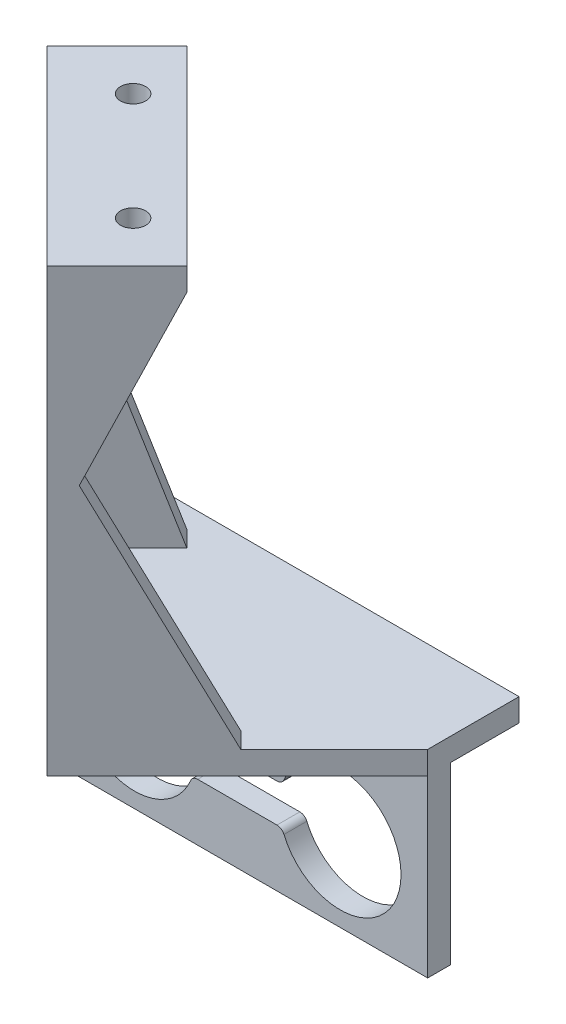
ISO-10303-21;
HEADER;
FILE_DESCRIPTION(('STEP AP214'),'2;1');
FILE_NAME('part.step','',(''),(''),'','','');
FILE_SCHEMA(('AUTOMOTIVE_DESIGN { 1 0 10303 214 1 1 1 1 }'));
ENDSEC;
DATA;
#1=APPLICATION_CONTEXT('core data for automotive mechanical design processes');
#2=APPLICATION_PROTOCOL_DEFINITION('international standard','automotive_design',2000,#1);
#3=PRODUCT_CONTEXT('',#1,'mechanical');
#4=PRODUCT('Part','Part','',(#3));
#5=PRODUCT_RELATED_PRODUCT_CATEGORY('part','',(#4));
#6=PRODUCT_DEFINITION_FORMATION('','',#4);
#7=PRODUCT_DEFINITION_CONTEXT('part definition',#1,'design');
#8=PRODUCT_DEFINITION('design','',#6,#7);
#9=PRODUCT_DEFINITION_SHAPE('','',#8);
#10=(LENGTH_UNIT() NAMED_UNIT(*) SI_UNIT(.MILLI.,.METRE.));
#11=(NAMED_UNIT(*) PLANE_ANGLE_UNIT() SI_UNIT($,.RADIAN.));
#12=(NAMED_UNIT(*) SI_UNIT($,.STERADIAN.) SOLID_ANGLE_UNIT());
#13=UNCERTAINTY_MEASURE_WITH_UNIT(LENGTH_MEASURE(1.E-05),#10,'distance_accuracy_value','');
#14=(GEOMETRIC_REPRESENTATION_CONTEXT(3) GLOBAL_UNCERTAINTY_ASSIGNED_CONTEXT((#13)) GLOBAL_UNIT_ASSIGNED_CONTEXT((#10,
#11,#12)) REPRESENTATION_CONTEXT('',''));
#15=CARTESIAN_POINT('',(0.,0.,0.));
#16=DIRECTION('',(0.,0.,1.));
#17=DIRECTION('',(1.,0.,0.));
#18=AXIS2_PLACEMENT_3D('',#15,#16,#17);
#19=CARTESIAN_POINT('',(2.12132034355976,71.,22.8786796564402));
#20=DIRECTION('',(0.707106781186548,0.,-0.707106781186547));
#21=DIRECTION('',(0.707106781186547,0.,0.707106781186548));
#22=AXIS2_PLACEMENT_3D('',#19,#20,#21);
#23=PLANE('',#22);
#24=DIRECTION('',(0.707106781186547,0.,0.707106781186548));
#25=VECTOR('',#24,1.);
#26=CARTESIAN_POINT('',(1.23165366794353E-13,68.,20.7573593128806));
#27=LINE('',#26,#25);
#28=CARTESIAN_POINT('',(-20.7573593128806,68.,-1.30537941567255E-13));
#29=VERTEX_POINT('',#28);
#30=CARTESIAN_POINT('',(1.22506171873482E-13,68.,20.7573593128806));
#31=VERTEX_POINT('',#30);
#32=EDGE_CURVE('E259',#29,#31,#27,.T.);
#33=ORIENTED_EDGE('',*,*,#32,.T.);
#34=DIRECTION('',(0.,-1.,0.));
#35=VECTOR('',#34,1.);
#36=CARTESIAN_POINT('',(0.,0.,20.7573593128805));
#37=LINE('',#36,#35);
#38=CARTESIAN_POINT('',(0.,46.,20.7573593128805));
#39=VERTEX_POINT('',#38);
#40=EDGE_CURVE('E503',#31,#39,#37,.T.);
#41=ORIENTED_EDGE('',*,*,#40,.T.);
#42=DIRECTION('',(0.,-1.,0.));
#43=VECTOR('',#42,1.);
#44=CARTESIAN_POINT('',(0.,0.,20.7573593128805));
#45=LINE('',#44,#43);
#46=CARTESIAN_POINT('',(0.,16.,20.7573593128805));
#47=VERTEX_POINT('',#46);
#48=EDGE_CURVE('E508',#39,#47,#45,.T.);
#49=ORIENTED_EDGE('',*,*,#48,.T.);
#50=DIRECTION('',(-0.707106781186547,0.,-0.707106781186548));
#51=VECTOR('',#50,1.);
#52=CARTESIAN_POINT('',(2.12132034355977,16.,22.8786796564402));
#53=LINE('',#52,#51);
#54=CARTESIAN_POINT('',(-20.7573593128806,16.,-1.27502175484295E-13));
#55=VERTEX_POINT('',#54);
#56=EDGE_CURVE('E267',#47,#55,#53,.T.);
#57=ORIENTED_EDGE('',*,*,#56,.T.);
#58=DIRECTION('',(0.,1.,0.));
#59=VECTOR('',#58,1.);
#60=CARTESIAN_POINT('',(-20.7573593128806,0.,-1.22731685925359E-13));
#61=LINE('',#60,#59);
#62=CARTESIAN_POINT('',(-20.7573593128806,46.,-1.24032728532342E-13));
#63=VERTEX_POINT('',#62);
#64=EDGE_CURVE('E489',#55,#63,#61,.T.);
#65=ORIENTED_EDGE('',*,*,#64,.T.);
#66=DIRECTION('',(0.,1.,0.));
#67=VECTOR('',#66,1.);
#68=CARTESIAN_POINT('',(-20.7573593128806,0.,-1.22731685925359E-13));
#69=LINE('',#68,#67);
#70=EDGE_CURVE('E919',#63,#29,#69,.T.);
#71=ORIENTED_EDGE('',*,*,#70,.T.);
#72=EDGE_LOOP('',(#33,#41,#49,#57,#65,#71));
#73=FACE_BOUND('',#72,.T.);
#74=ADVANCED_FACE('F39',(#73),#23,.T.);
#75=CARTESIAN_POINT('',(7.0710678118656,68.,13.6862915010151));
#76=DIRECTION('',(0.,1.,0.));
#77=DIRECTION('',(-1.,0.,0.));
#78=AXIS2_PLACEMENT_3D('',#75,#76,#77);
#79=PLANE('',#78);
#80=CARTESIAN_POINT('',(0.227922061357971,68.,13.914213562373));
#81=DIRECTION('',(0.,1.,0.));
#82=DIRECTION('',(0.,0.,1.));
#83=AXIS2_PLACEMENT_3D('',#80,#81,#82);
#84=CIRCLE('',#83,1.65);
#85=CARTESIAN_POINT('',(0.227922061357971,68.,15.564213562373));
#86=VERTEX_POINT('',#85);
#87=EDGE_CURVE('E907',#86,#86,#84,.T.);
#88=ORIENTED_EDGE('',*,*,#87,.T.);
#89=EDGE_LOOP('',(#88));
#90=FACE_BOUND('',#89,.T.);
#91=CARTESIAN_POINT('',(-13.914213562373,68.,-0.227922061357981));
#92=DIRECTION('',(0.,1.,0.));
#93=DIRECTION('',(0.,0.,1.));
#94=AXIS2_PLACEMENT_3D('',#91,#92,#93);
#95=CIRCLE('',#94,1.65);
#96=CARTESIAN_POINT('',(-13.914213562373,68.,1.42207793864202));
#97=VERTEX_POINT('',#96);
#98=EDGE_CURVE('E913',#97,#97,#95,.T.);
#99=ORIENTED_EDGE('',*,*,#98,.T.);
#100=EDGE_LOOP('',(#99));
#101=FACE_BOUND('',#100,.T.);
#102=DIRECTION('',(0.707106781186549,0.,-0.707106781186547));
#103=VECTOR('',#102,1.);
#104=CARTESIAN_POINT('',(-10.3786796564403,68.,-10.3786796564404));
#105=LINE('',#104,#103);
#106=CARTESIAN_POINT('',(-13.6862915010151,68.,-7.0710678118656));
#107=VERTEX_POINT('',#106);
#108=EDGE_CURVE('E252',#29,#107,#105,.T.);
#109=ORIENTED_EDGE('',*,*,#108,.T.);
#110=DIRECTION('',(0.707106781186547,0.,0.707106781186548));
#111=VECTOR('',#110,1.);
#112=CARTESIAN_POINT('',(7.0710678118656,68.,13.6862915010151));
#113=LINE('',#112,#111);
#114=CARTESIAN_POINT('',(7.0710678118656,68.,13.6862915010151));
#115=VERTEX_POINT('',#114);
#116=EDGE_CURVE('E244',#107,#115,#113,.T.);
#117=ORIENTED_EDGE('',*,*,#116,.T.);
#118=DIRECTION('',(-0.707106781186548,0.,0.707106781186547));
#119=VECTOR('',#118,1.);
#120=CARTESIAN_POINT('',(7.0710678118656,68.,13.6862915010151));
#121=LINE('',#120,#119);
#122=EDGE_CURVE('E247',#115,#31,#121,.T.);
#123=ORIENTED_EDGE('',*,*,#122,.T.);
#124=ORIENTED_EDGE('',*,*,#32,.F.);
#125=EDGE_LOOP('',(#109,#117,#123,#124));
#126=FACE_BOUND('',#125,.T.);
#127=ADVANCED_FACE('F542',(#90,#101,#126),#79,.F.);
#128=CARTESIAN_POINT('',(0.,16.,0.));
#129=DIRECTION('',(0.,1.,0.));
#130=DIRECTION('',(-1.,0.,0.));
#131=AXIS2_PLACEMENT_3D('',#128,#129,#130);
#132=PLANE('',#131);
#133=ORIENTED_EDGE('',*,*,#56,.F.);
#134=DIRECTION('',(0.707106781186551,0.,-0.707106781186544));
#135=VECTOR('',#134,1.);
#136=CARTESIAN_POINT('',(10.3786796564402,16.,10.3786796564403));
#137=LINE('',#136,#135);
#138=CARTESIAN_POINT('',(10.6066017177983,16.,10.1507575950823));
#139=VERTEX_POINT('',#138);
#140=EDGE_CURVE('E513',#47,#139,#137,.T.);
#141=ORIENTED_EDGE('',*,*,#140,.T.);
#142=DIRECTION('',(0.707106781186544,0.,0.707106781186551));
#143=VECTOR('',#142,1.);
#144=CARTESIAN_POINT('',(10.6066017177983,16.,10.1507575950823));
#145=LINE('',#144,#143);
#146=CARTESIAN_POINT('',(12.7279220613579,16.,12.272077938642));
#147=VERTEX_POINT('',#146);
#148=EDGE_CURVE('E265',#139,#147,#145,.T.);
#149=ORIENTED_EDGE('',*,*,#148,.T.);
#150=DIRECTION('',(-0.707106781186551,0.,0.707106781186544));
#151=VECTOR('',#150,1.);
#152=CARTESIAN_POINT('',(25.,16.,0.));
#153=LINE('',#152,#151);
#154=CARTESIAN_POINT('',(25.,16.,0.));
#155=VERTEX_POINT('',#154);
#156=EDGE_CURVE('E282',#155,#147,#153,.T.);
#157=ORIENTED_EDGE('',*,*,#156,.F.);
#158=DIRECTION('',(0.,0.,1.));
#159=VECTOR('',#158,1.);
#160=CARTESIAN_POINT('',(25.,16.,0.));
#161=LINE('',#160,#159);
#162=CARTESIAN_POINT('',(25.,16.,-12.));
#163=VERTEX_POINT('',#162);
#164=EDGE_CURVE('E313',#163,#155,#161,.T.);
#165=ORIENTED_EDGE('',*,*,#164,.F.);
#166=DIRECTION('',(1.,0.,0.));
#167=VECTOR('',#166,1.);
#168=CARTESIAN_POINT('',(-25.,16.,-12.));
#169=LINE('',#168,#167);
#170=CARTESIAN_POINT('',(-25.,16.,-12.));
#171=VERTEX_POINT('',#170);
#172=EDGE_CURVE('E310',#171,#163,#169,.T.);
#173=ORIENTED_EDGE('',*,*,#172,.F.);
#174=DIRECTION('',(0.,0.,-1.));
#175=VECTOR('',#174,1.);
#176=CARTESIAN_POINT('',(-25.,16.,0.));
#177=LINE('',#176,#175);
#178=CARTESIAN_POINT('',(-25.,16.,0.));
#179=VERTEX_POINT('',#178);
#180=EDGE_CURVE('E307',#179,#171,#177,.T.);
#181=ORIENTED_EDGE('',*,*,#180,.F.);
#182=DIRECTION('',(0.707106781186549,0.,-0.707106781186546));
#183=VECTOR('',#182,1.);
#184=CARTESIAN_POINT('',(-25.,16.,0.));
#185=LINE('',#184,#183);
#186=CARTESIAN_POINT('',(-15.8076118445747,16.,-9.19238815542524));
#187=VERTEX_POINT('',#186);
#188=EDGE_CURVE('E271',#179,#187,#185,.T.);
#189=ORIENTED_EDGE('',*,*,#188,.T.);
#190=DIRECTION('',(-0.707106781186546,0.,-0.707106781186548));
#191=VECTOR('',#190,1.);
#192=CARTESIAN_POINT('',(-13.6862915010151,16.,-7.07106781186559));
#193=LINE('',#192,#191);
#194=CARTESIAN_POINT('',(-13.6862915010151,16.,-7.0710678118656));
#195=VERTEX_POINT('',#194);
#196=EDGE_CURVE('E486',#195,#187,#193,.T.);
#197=ORIENTED_EDGE('',*,*,#196,.F.);
#198=DIRECTION('',(0.707106781186549,0.,-0.707106781186547));
#199=VECTOR('',#198,1.);
#200=CARTESIAN_POINT('',(-10.3786796564403,16.,-10.3786796564404));
#201=LINE('',#200,#199);
#202=EDGE_CURVE('E487',#55,#195,#201,.T.);
#203=ORIENTED_EDGE('',*,*,#202,.F.);
#204=EDGE_LOOP('',(#133,#141,#149,#157,#165,#173,#181,#189,#197,#203));
#205=FACE_BOUND('',#204,.T.);
#206=ADVANCED_FACE('F468',(#205),#132,.T.);
#207=CARTESIAN_POINT('',(-25.,16.,-12.));
#208=DIRECTION('',(0.,0.,1.));
#209=DIRECTION('',(-1.,0.,0.));
#210=AXIS2_PLACEMENT_3D('',#207,#208,#209);
#211=PLANE('',#210);
#212=DIRECTION('',(-1.,0.,0.));
#213=VECTOR('',#212,1.);
#214=CARTESIAN_POINT('',(25.,13.,-12.));
#215=LINE('',#214,#213);
#216=CARTESIAN_POINT('',(25.,13.,-12.));
#217=VERTEX_POINT('',#216);
#218=CARTESIAN_POINT('',(-25.,13.,-12.));
#219=VERTEX_POINT('',#218);
#220=EDGE_CURVE('E299',#217,#219,#215,.T.);
#221=ORIENTED_EDGE('',*,*,#220,.T.);
#222=DIRECTION('',(0.,-1.,0.));
#223=VECTOR('',#222,1.);
#224=CARTESIAN_POINT('',(-25.,16.,-12.));
#225=LINE('',#224,#223);
#226=EDGE_CURVE('E319',#171,#219,#225,.T.);
#227=ORIENTED_EDGE('',*,*,#226,.F.);
#228=ORIENTED_EDGE('',*,*,#172,.T.);
#229=DIRECTION('',(0.,-1.,0.));
#230=VECTOR('',#229,1.);
#231=CARTESIAN_POINT('',(25.,16.,-12.));
#232=LINE('',#231,#230);
#233=EDGE_CURVE('E316',#163,#217,#232,.T.);
#234=ORIENTED_EDGE('',*,*,#233,.T.);
#235=EDGE_LOOP('',(#221,#227,#228,#234));
#236=FACE_BOUND('',#235,.T.);
#237=ADVANCED_FACE('F461',(#236),#211,.F.);
#238=CARTESIAN_POINT('',(0.,0.,-3.));
#239=DIRECTION('',(0.,0.,-1.));
#240=DIRECTION('',(1.,0.,0.));
#241=AXIS2_PLACEMENT_3D('',#238,#239,#240);
#242=PLANE('',#241);
#243=DIRECTION('',(0.,-1.,0.));
#244=VECTOR('',#243,1.);
#245=CARTESIAN_POINT('',(-25.,-10.,-3.));
#246=LINE('',#245,#244);
#247=CARTESIAN_POINT('',(-25.,13.,-3.));
#248=VERTEX_POINT('',#247);
#249=CARTESIAN_POINT('',(-25.,-10.,-3.));
#250=VERTEX_POINT('',#249);
#251=EDGE_CURVE('E419',#248,#250,#246,.T.);
#252=ORIENTED_EDGE('',*,*,#251,.F.);
#253=DIRECTION('',(1.,0.,0.));
#254=VECTOR('',#253,1.);
#255=CARTESIAN_POINT('',(25.,13.,-3.));
#256=LINE('',#255,#254);
#257=CARTESIAN_POINT('',(25.,13.,-3.));
#258=VERTEX_POINT('',#257);
#259=EDGE_CURVE('E304',#248,#258,#256,.T.);
#260=ORIENTED_EDGE('',*,*,#259,.T.);
#261=DIRECTION('',(0.,1.,0.));
#262=VECTOR('',#261,1.);
#263=CARTESIAN_POINT('',(25.,-10.,-3.));
#264=LINE('',#263,#262);
#265=CARTESIAN_POINT('',(25.,-10.,-3.));
#266=VERTEX_POINT('',#265);
#267=EDGE_CURVE('E426',#266,#258,#264,.T.);
#268=ORIENTED_EDGE('',*,*,#267,.F.);
#269=DIRECTION('',(1.,0.,0.));
#270=VECTOR('',#269,1.);
#271=CARTESIAN_POINT('',(25.,-10.,-3.));
#272=LINE('',#271,#270);
#273=EDGE_CURVE('E422',#250,#266,#272,.T.);
#274=ORIENTED_EDGE('',*,*,#273,.F.);
#275=EDGE_LOOP('',(#252,#260,#268,#274));
#276=FACE_BOUND('',#275,.T.);
#277=CARTESIAN_POINT('',(13.5,0.,-3.));
#278=DIRECTION('',(0.,0.,1.));
#279=DIRECTION('',(1.,0.,0.));
#280=AXIS2_PLACEMENT_3D('',#277,#278,#279);
#281=CIRCLE('',#280,8.);
#282=CARTESIAN_POINT('',(6.12972268809911,-3.11111111111111,-3.));
#283=VERTEX_POINT('',#282);
#284=CARTESIAN_POINT('',(6.12972268809911,3.11111111111111,-3.));
#285=VERTEX_POINT('',#284);
#286=EDGE_CURVE('E358',#283,#285,#281,.T.);
#287=ORIENTED_EDGE('',*,*,#286,.T.);
#288=CARTESIAN_POINT('',(5.2084380241115,3.5,-3.));
#289=DIRECTION('',(0.,0.,-1.));
#290=DIRECTION('',(1.,0.,0.));
#291=AXIS2_PLACEMENT_3D('',#288,#289,#290);
#292=CIRCLE('',#291,1.);
#293=CARTESIAN_POINT('',(5.2084380241115,2.5,-3.));
#294=VERTEX_POINT('',#293);
#295=EDGE_CURVE('E362',#285,#294,#292,.T.);
#296=ORIENTED_EDGE('',*,*,#295,.T.);
#297=DIRECTION('',(-1.,0.,0.));
#298=VECTOR('',#297,1.);
#299=CARTESIAN_POINT('',(-5.2084380241115,2.5,-3.));
#300=LINE('',#299,#298);
#301=CARTESIAN_POINT('',(-5.2084380241115,2.5,-3.));
#302=VERTEX_POINT('',#301);
#303=EDGE_CURVE('E365',#294,#302,#300,.T.);
#304=ORIENTED_EDGE('',*,*,#303,.T.);
#305=CARTESIAN_POINT('',(-5.2084380241115,3.5,-3.));
#306=DIRECTION('',(0.,0.,-1.));
#307=DIRECTION('',(-1.,0.,0.));
#308=AXIS2_PLACEMENT_3D('',#305,#306,#307);
#309=CIRCLE('',#308,1.);
#310=CARTESIAN_POINT('',(-6.12972268809911,3.11111111111111,-3.));
#311=VERTEX_POINT('',#310);
#312=EDGE_CURVE('E368',#302,#311,#309,.T.);
#313=ORIENTED_EDGE('',*,*,#312,.T.);
#314=CARTESIAN_POINT('',(-13.5,0.,-3.));
#315=DIRECTION('',(0.,0.,1.));
#316=DIRECTION('',(1.,0.,0.));
#317=AXIS2_PLACEMENT_3D('',#314,#315,#316);
#318=CIRCLE('',#317,8.);
#319=CARTESIAN_POINT('',(-6.12972268809911,-3.11111111111111,-3.));
#320=VERTEX_POINT('',#319);
#321=EDGE_CURVE('E371',#311,#320,#318,.T.);
#322=ORIENTED_EDGE('',*,*,#321,.T.);
#323=CARTESIAN_POINT('',(-5.2084380241115,-3.5,-3.));
#324=DIRECTION('',(0.,0.,-1.));
#325=DIRECTION('',(1.,0.,0.));
#326=AXIS2_PLACEMENT_3D('',#323,#324,#325);
#327=CIRCLE('',#326,1.);
#328=CARTESIAN_POINT('',(-5.2084380241115,-2.5,-3.));
#329=VERTEX_POINT('',#328);
#330=EDGE_CURVE('E374',#320,#329,#327,.T.);
#331=ORIENTED_EDGE('',*,*,#330,.T.);
#332=DIRECTION('',(1.,0.,0.));
#333=VECTOR('',#332,1.);
#334=CARTESIAN_POINT('',(5.2084380241115,-2.5,-3.));
#335=LINE('',#334,#333);
#336=CARTESIAN_POINT('',(5.2084380241115,-2.5,-3.));
#337=VERTEX_POINT('',#336);
#338=EDGE_CURVE('E377',#329,#337,#335,.T.);
#339=ORIENTED_EDGE('',*,*,#338,.T.);
#340=CARTESIAN_POINT('',(5.2084380241115,-3.5,-3.));
#341=DIRECTION('',(0.,0.,-1.));
#342=DIRECTION('',(-1.,0.,0.));
#343=AXIS2_PLACEMENT_3D('',#340,#341,#342);
#344=CIRCLE('',#343,1.);
#345=EDGE_CURVE('E355',#337,#283,#344,.T.);
#346=ORIENTED_EDGE('',*,*,#345,.T.);
#347=EDGE_LOOP('',(#287,#296,#304,#313,#322,#331,#339,#346));
#348=FACE_BOUND('',#347,.T.);
#349=DIRECTION('',(-1.,0.,0.));
#350=VECTOR('',#349,1.);
#351=CARTESIAN_POINT('',(3.25,9.,-3.));
#352=LINE('',#351,#350);
#353=CARTESIAN_POINT('',(3.25,9.,-3.));
#354=VERTEX_POINT('',#353);
#355=CARTESIAN_POINT('',(-3.25,9.,-3.));
#356=VERTEX_POINT('',#355);
#357=EDGE_CURVE('E326',#354,#356,#352,.T.);
#358=ORIENTED_EDGE('',*,*,#357,.T.);
#359=CARTESIAN_POINT('',(-3.25,7.25,-3.));
#360=DIRECTION('',(0.,0.,1.));
#361=DIRECTION('',(1.,0.,0.));
#362=AXIS2_PLACEMENT_3D('',#359,#360,#361);
#363=CIRCLE('',#362,1.75);
#364=CARTESIAN_POINT('',(-3.25,5.5,-3.));
#365=VERTEX_POINT('',#364);
#366=EDGE_CURVE('E330',#356,#365,#363,.T.);
#367=ORIENTED_EDGE('',*,*,#366,.T.);
#368=DIRECTION('',(1.,0.,0.));
#369=VECTOR('',#368,1.);
#370=CARTESIAN_POINT('',(3.25,5.5,-3.));
#371=LINE('',#370,#369);
#372=CARTESIAN_POINT('',(3.25,5.5,-3.));
#373=VERTEX_POINT('',#372);
#374=EDGE_CURVE('E333',#365,#373,#371,.T.);
#375=ORIENTED_EDGE('',*,*,#374,.T.);
#376=CARTESIAN_POINT('',(3.25,7.25,-3.));
#377=DIRECTION('',(0.,0.,1.));
#378=DIRECTION('',(1.,0.,0.));
#379=AXIS2_PLACEMENT_3D('',#376,#377,#378);
#380=CIRCLE('',#379,1.75);
#381=EDGE_CURVE('E323',#373,#354,#380,.T.);
#382=ORIENTED_EDGE('',*,*,#381,.T.);
#383=EDGE_LOOP('',(#358,#367,#375,#382));
#384=FACE_BOUND('',#383,.T.);
#385=ADVANCED_FACE('F455',(#276,#348,#384),#242,.T.);
#386=CARTESIAN_POINT('',(0.,0.,0.));
#387=DIRECTION('',(0.,0.,-1.));
#388=DIRECTION('',(1.,0.,0.));
#389=AXIS2_PLACEMENT_3D('',#386,#387,#388);
#390=PLANE('',#389);
#391=CARTESIAN_POINT('',(5.2084380241115,-3.5,0.));
#392=DIRECTION('',(0.,0.,-1.));
#393=DIRECTION('',(-1.,0.,0.));
#394=AXIS2_PLACEMENT_3D('',#391,#392,#393);
#395=CIRCLE('',#394,1.);
#396=CARTESIAN_POINT('',(5.2084380241115,-2.5,0.));
#397=VERTEX_POINT('',#396);
#398=CARTESIAN_POINT('',(6.12972268809911,-3.11111111111111,0.));
#399=VERTEX_POINT('',#398);
#400=EDGE_CURVE('E354',#397,#399,#395,.T.);
#401=ORIENTED_EDGE('',*,*,#400,.F.);
#402=DIRECTION('',(1.,0.,0.));
#403=VECTOR('',#402,1.);
#404=CARTESIAN_POINT('',(5.2084380241115,-2.5,0.));
#405=LINE('',#404,#403);
#406=CARTESIAN_POINT('',(-5.2084380241115,-2.5,0.));
#407=VERTEX_POINT('',#406);
#408=EDGE_CURVE('E359',#407,#397,#405,.T.);
#409=ORIENTED_EDGE('',*,*,#408,.F.);
#410=CARTESIAN_POINT('',(-5.2084380241115,-3.5,0.));
#411=DIRECTION('',(0.,0.,-1.));
#412=DIRECTION('',(1.,0.,0.));
#413=AXIS2_PLACEMENT_3D('',#410,#411,#412);
#414=CIRCLE('',#413,1.);
#415=CARTESIAN_POINT('',(-6.12972268809911,-3.11111111111111,0.));
#416=VERTEX_POINT('',#415);
#417=EDGE_CURVE('E398',#416,#407,#414,.T.);
#418=ORIENTED_EDGE('',*,*,#417,.F.);
#419=CARTESIAN_POINT('',(-13.5,0.,0.));
#420=DIRECTION('',(0.,0.,1.));
#421=DIRECTION('',(1.,0.,0.));
#422=AXIS2_PLACEMENT_3D('',#419,#420,#421);
#423=CIRCLE('',#422,8.);
#424=CARTESIAN_POINT('',(-6.12972268809911,3.11111111111111,0.));
#425=VERTEX_POINT('',#424);
#426=EDGE_CURVE('E395',#425,#416,#423,.T.);
#427=ORIENTED_EDGE('',*,*,#426,.F.);
#428=CARTESIAN_POINT('',(-5.2084380241115,3.5,0.));
#429=DIRECTION('',(0.,0.,-1.));
#430=DIRECTION('',(-1.,0.,0.));
#431=AXIS2_PLACEMENT_3D('',#428,#429,#430);
#432=CIRCLE('',#431,1.);
#433=CARTESIAN_POINT('',(-5.2084380241115,2.5,0.));
#434=VERTEX_POINT('',#433);
#435=EDGE_CURVE('E392',#434,#425,#432,.T.);
#436=ORIENTED_EDGE('',*,*,#435,.F.);
#437=DIRECTION('',(-1.,0.,0.));
#438=VECTOR('',#437,1.);
#439=CARTESIAN_POINT('',(-5.2084380241115,2.5,0.));
#440=LINE('',#439,#438);
#441=CARTESIAN_POINT('',(5.2084380241115,2.5,0.));
#442=VERTEX_POINT('',#441);
#443=EDGE_CURVE('E389',#442,#434,#440,.T.);
#444=ORIENTED_EDGE('',*,*,#443,.F.);
#445=CARTESIAN_POINT('',(5.2084380241115,3.5,0.));
#446=DIRECTION('',(0.,0.,-1.));
#447=DIRECTION('',(1.,0.,0.));
#448=AXIS2_PLACEMENT_3D('',#445,#446,#447);
#449=CIRCLE('',#448,1.);
#450=CARTESIAN_POINT('',(6.12972268809911,3.11111111111111,0.));
#451=VERTEX_POINT('',#450);
#452=EDGE_CURVE('E386',#451,#442,#449,.T.);
#453=ORIENTED_EDGE('',*,*,#452,.F.);
#454=CARTESIAN_POINT('',(13.5,0.,0.));
#455=DIRECTION('',(0.,0.,1.));
#456=DIRECTION('',(1.,0.,0.));
#457=AXIS2_PLACEMENT_3D('',#454,#455,#456);
#458=CIRCLE('',#457,8.);
#459=EDGE_CURVE('E383',#399,#451,#458,.T.);
#460=ORIENTED_EDGE('',*,*,#459,.F.);
#461=EDGE_LOOP('',(#401,#409,#418,#427,#436,#444,#453,#460));
#462=FACE_BOUND('',#461,.T.);
#463=DIRECTION('',(0.,-1.,0.));
#464=VECTOR('',#463,1.);
#465=CARTESIAN_POINT('',(-25.,-10.,0.));
#466=LINE('',#465,#464);
#467=CARTESIAN_POINT('',(-25.,13.,0.));
#468=VERTEX_POINT('',#467);
#469=CARTESIAN_POINT('',(-25.,-10.,0.));
#470=VERTEX_POINT('',#469);
#471=EDGE_CURVE('E418',#468,#470,#466,.T.);
#472=ORIENTED_EDGE('',*,*,#471,.T.);
#473=DIRECTION('',(1.,0.,0.));
#474=VECTOR('',#473,1.);
#475=CARTESIAN_POINT('',(25.,-10.,0.));
#476=LINE('',#475,#474);
#477=CARTESIAN_POINT('',(25.,-10.,0.));
#478=VERTEX_POINT('',#477);
#479=EDGE_CURVE('E432',#470,#478,#476,.T.);
#480=ORIENTED_EDGE('',*,*,#479,.T.);
#481=DIRECTION('',(0.,1.,0.));
#482=VECTOR('',#481,1.);
#483=CARTESIAN_POINT('',(25.,-10.,0.));
#484=LINE('',#483,#482);
#485=CARTESIAN_POINT('',(25.,13.,0.));
#486=VERTEX_POINT('',#485);
#487=EDGE_CURVE('E423',#478,#486,#484,.T.);
#488=ORIENTED_EDGE('',*,*,#487,.T.);
#489=DIRECTION('',(1.,0.,0.));
#490=VECTOR('',#489,1.);
#491=CARTESIAN_POINT('',(25.,13.,0.));
#492=LINE('',#491,#490);
#493=EDGE_CURVE('E283',#468,#486,#492,.T.);
#494=ORIENTED_EDGE('',*,*,#493,.F.);
#495=EDGE_LOOP('',(#472,#480,#488,#494));
#496=FACE_BOUND('',#495,.T.);
#497=CARTESIAN_POINT('',(3.25,7.25,0.));
#498=DIRECTION('',(0.,0.,1.));
#499=DIRECTION('',(1.,0.,0.));
#500=AXIS2_PLACEMENT_3D('',#497,#498,#499);
#501=CIRCLE('',#500,1.75);
#502=CARTESIAN_POINT('',(3.25,5.5,0.));
#503=VERTEX_POINT('',#502);
#504=CARTESIAN_POINT('',(3.25,9.,0.));
#505=VERTEX_POINT('',#504);
#506=EDGE_CURVE('E322',#503,#505,#501,.T.);
#507=ORIENTED_EDGE('',*,*,#506,.F.);
#508=DIRECTION('',(1.,0.,0.));
#509=VECTOR('',#508,1.);
#510=CARTESIAN_POINT('',(3.25,5.5,0.));
#511=LINE('',#510,#509);
#512=CARTESIAN_POINT('',(-3.25,5.5,0.));
#513=VERTEX_POINT('',#512);
#514=EDGE_CURVE('E327',#513,#503,#511,.T.);
#515=ORIENTED_EDGE('',*,*,#514,.F.);
#516=CARTESIAN_POINT('',(-3.25,7.25,0.));
#517=DIRECTION('',(0.,0.,1.));
#518=DIRECTION('',(1.,0.,0.));
#519=AXIS2_PLACEMENT_3D('',#516,#517,#518);
#520=CIRCLE('',#519,1.75);
#521=CARTESIAN_POINT('',(-3.25,9.,0.));
#522=VERTEX_POINT('',#521);
#523=EDGE_CURVE('E342',#522,#513,#520,.T.);
#524=ORIENTED_EDGE('',*,*,#523,.F.);
#525=DIRECTION('',(-1.,0.,0.));
#526=VECTOR('',#525,1.);
#527=CARTESIAN_POINT('',(3.25,9.,0.));
#528=LINE('',#527,#526);
#529=EDGE_CURVE('E339',#505,#522,#528,.T.);
#530=ORIENTED_EDGE('',*,*,#529,.F.);
#531=EDGE_LOOP('',(#507,#515,#524,#530));
#532=FACE_BOUND('',#531,.T.);
#533=ADVANCED_FACE('F448',(#462,#496,#532),#390,.F.);
#534=CARTESIAN_POINT('',(-25.,-10.,-3.));
#535=DIRECTION('',(1.,0.,0.));
#536=DIRECTION('',(0.,0.,1.));
#537=AXIS2_PLACEMENT_3D('',#534,#535,#536);
#538=PLANE('',#537);
#539=ORIENTED_EDGE('',*,*,#251,.T.);
#540=DIRECTION('',(0.,0.,1.));
#541=VECTOR('',#540,1.);
#542=CARTESIAN_POINT('',(-25.,-10.,-3.));
#543=LINE('',#542,#541);
#544=EDGE_CURVE('E11',#250,#470,#543,.T.);
#545=ORIENTED_EDGE('',*,*,#544,.T.);
#546=ORIENTED_EDGE('',*,*,#471,.F.);
#547=EDGE_CURVE('E429',#179,#468,#466,.T.);
#548=ORIENTED_EDGE('',*,*,#547,.F.);
#549=ORIENTED_EDGE('',*,*,#180,.T.);
#550=ORIENTED_EDGE('',*,*,#226,.T.);
#551=DIRECTION('',(0.,0.,1.));
#552=VECTOR('',#551,1.);
#553=CARTESIAN_POINT('',(-25.,13.,-3.));
#554=LINE('',#553,#552);
#555=EDGE_CURVE('E302',#219,#248,#554,.T.);
#556=ORIENTED_EDGE('',*,*,#555,.T.);
#557=EDGE_LOOP('',(#539,#545,#546,#548,#549,#550,#556));
#558=FACE_BOUND('',#557,.T.);
#559=ADVANCED_FACE('F41',(#558),#538,.F.);
#560=CARTESIAN_POINT('',(25.,-10.,-3.));
#561=DIRECTION('',(0.,1.,0.));
#562=DIRECTION('',(-1.,0.,0.));
#563=AXIS2_PLACEMENT_3D('',#560,#561,#562);
#564=PLANE('',#563);
#565=ORIENTED_EDGE('',*,*,#479,.F.);
#566=ORIENTED_EDGE('',*,*,#544,.F.);
#567=ORIENTED_EDGE('',*,*,#273,.T.);
#568=DIRECTION('',(0.,0.,1.));
#569=VECTOR('',#568,1.);
#570=CARTESIAN_POINT('',(25.,-10.,-3.));
#571=LINE('',#570,#569);
#572=EDGE_CURVE('E47',#266,#478,#571,.T.);
#573=ORIENTED_EDGE('',*,*,#572,.T.);
#574=EDGE_LOOP('',(#565,#566,#567,#573));
#575=FACE_BOUND('',#574,.T.);
#576=ADVANCED_FACE('F439',(#575),#564,.F.);
#577=CARTESIAN_POINT('',(25.,-10.,-3.));
#578=DIRECTION('',(-1.,0.,0.));
#579=DIRECTION('',(0.,0.,-1.));
#580=AXIS2_PLACEMENT_3D('',#577,#578,#579);
#581=PLANE('',#580);
#582=DIRECTION('',(0.,0.,-1.));
#583=VECTOR('',#582,1.);
#584=CARTESIAN_POINT('',(25.,13.,-3.));
#585=LINE('',#584,#583);
#586=EDGE_CURVE('E296',#258,#217,#585,.T.);
#587=ORIENTED_EDGE('',*,*,#586,.T.);
#588=ORIENTED_EDGE('',*,*,#233,.F.);
#589=ORIENTED_EDGE('',*,*,#164,.T.);
#590=DIRECTION('',(0.,1.,0.));
#591=VECTOR('',#590,1.);
#592=CARTESIAN_POINT('',(25.,13.,0.));
#593=LINE('',#592,#591);
#594=EDGE_CURVE('E290',#486,#155,#593,.T.);
#595=ORIENTED_EDGE('',*,*,#594,.F.);
#596=ORIENTED_EDGE('',*,*,#487,.F.);
#597=ORIENTED_EDGE('',*,*,#572,.F.);
#598=ORIENTED_EDGE('',*,*,#267,.T.);
#599=EDGE_LOOP('',(#587,#588,#589,#595,#596,#597,#598));
#600=FACE_BOUND('',#599,.T.);
#601=ADVANCED_FACE('F445',(#600),#581,.F.);
#602=CARTESIAN_POINT('',(5.2084380241115,-3.5,-3.));
#603=DIRECTION('',(0.,0.,1.));
#604=DIRECTION('',(-1.,0.,0.));
#605=AXIS2_PLACEMENT_3D('',#602,#603,#604);
#606=CYLINDRICAL_SURFACE('',#605,1.);
#607=ORIENTED_EDGE('',*,*,#400,.T.);
#608=DIRECTION('',(0.,0.,1.));
#609=VECTOR('',#608,1.);
#610=CARTESIAN_POINT('',(6.12972268809911,-3.11111111111111,-3.));
#611=LINE('',#610,#609);
#612=EDGE_CURVE('E416',#283,#399,#611,.T.);
#613=ORIENTED_EDGE('',*,*,#612,.F.);
#614=ORIENTED_EDGE('',*,*,#345,.F.);
#615=DIRECTION('',(0.,0.,1.));
#616=VECTOR('',#615,1.);
#617=CARTESIAN_POINT('',(5.2084380241115,-2.5,-3.));
#618=LINE('',#617,#616);
#619=EDGE_CURVE('E380',#337,#397,#618,.T.);
#620=ORIENTED_EDGE('',*,*,#619,.T.);
#621=EDGE_LOOP('',(#607,#613,#614,#620));
#622=FACE_BOUND('',#621,.T.);
#623=ADVANCED_FACE('F605',(#622),#606,.T.);
#624=CARTESIAN_POINT('',(13.5,0.,-3.));
#625=DIRECTION('',(0.,0.,1.));
#626=DIRECTION('',(-1.,0.,0.));
#627=AXIS2_PLACEMENT_3D('',#624,#625,#626);
#628=CYLINDRICAL_SURFACE('',#627,8.);
#629=ORIENTED_EDGE('',*,*,#459,.T.);
#630=DIRECTION('',(0.,0.,1.));
#631=VECTOR('',#630,1.);
#632=CARTESIAN_POINT('',(6.12972268809911,3.11111111111111,-3.));
#633=LINE('',#632,#631);
#634=EDGE_CURVE('E414',#285,#451,#633,.T.);
#635=ORIENTED_EDGE('',*,*,#634,.F.);
#636=ORIENTED_EDGE('',*,*,#286,.F.);
#637=ORIENTED_EDGE('',*,*,#612,.T.);
#638=EDGE_LOOP('',(#629,#635,#636,#637));
#639=FACE_BOUND('',#638,.T.);
#640=ADVANCED_FACE('F601',(#639),#628,.F.);
#641=CARTESIAN_POINT('',(5.2084380241115,3.5,-3.));
#642=DIRECTION('',(0.,0.,1.));
#643=DIRECTION('',(-1.,0.,0.));
#644=AXIS2_PLACEMENT_3D('',#641,#642,#643);
#645=CYLINDRICAL_SURFACE('',#644,1.);
#646=ORIENTED_EDGE('',*,*,#452,.T.);
#647=DIRECTION('',(0.,0.,1.));
#648=VECTOR('',#647,1.);
#649=CARTESIAN_POINT('',(5.2084380241115,2.5,-3.));
#650=LINE('',#649,#648);
#651=EDGE_CURVE('E412',#294,#442,#650,.T.);
#652=ORIENTED_EDGE('',*,*,#651,.F.);
#653=ORIENTED_EDGE('',*,*,#295,.F.);
#654=ORIENTED_EDGE('',*,*,#634,.T.);
#655=EDGE_LOOP('',(#646,#652,#653,#654));
#656=FACE_BOUND('',#655,.T.);
#657=ADVANCED_FACE('F597',(#656),#645,.T.);
#658=CARTESIAN_POINT('',(-5.2084380241115,2.5,-3.));
#659=DIRECTION('',(0.,-1.,0.));
#660=DIRECTION('',(0.,0.,1.));
#661=AXIS2_PLACEMENT_3D('',#658,#659,#660);
#662=PLANE('',#661);
#663=ORIENTED_EDGE('',*,*,#443,.T.);
#664=DIRECTION('',(0.,0.,1.));
#665=VECTOR('',#664,1.);
#666=CARTESIAN_POINT('',(-5.2084380241115,2.5,-3.));
#667=LINE('',#666,#665);
#668=EDGE_CURVE('E410',#302,#434,#667,.T.);
#669=ORIENTED_EDGE('',*,*,#668,.F.);
#670=ORIENTED_EDGE('',*,*,#303,.F.);
#671=ORIENTED_EDGE('',*,*,#651,.T.);
#672=EDGE_LOOP('',(#663,#669,#670,#671));
#673=FACE_BOUND('',#672,.T.);
#674=ADVANCED_FACE('F593',(#673),#662,.T.);
#675=CARTESIAN_POINT('',(-5.2084380241115,3.5,-3.));
#676=DIRECTION('',(0.,0.,1.));
#677=DIRECTION('',(-1.,0.,0.));
#678=AXIS2_PLACEMENT_3D('',#675,#676,#677);
#679=CYLINDRICAL_SURFACE('',#678,1.);
#680=ORIENTED_EDGE('',*,*,#435,.T.);
#681=DIRECTION('',(0.,0.,1.));
#682=VECTOR('',#681,1.);
#683=CARTESIAN_POINT('',(-6.12972268809911,3.11111111111111,-3.));
#684=LINE('',#683,#682);
#685=EDGE_CURVE('E408',#311,#425,#684,.T.);
#686=ORIENTED_EDGE('',*,*,#685,.F.);
#687=ORIENTED_EDGE('',*,*,#312,.F.);
#688=ORIENTED_EDGE('',*,*,#668,.T.);
#689=EDGE_LOOP('',(#680,#686,#687,#688));
#690=FACE_BOUND('',#689,.T.);
#691=ADVANCED_FACE('F589',(#690),#679,.T.);
#692=CARTESIAN_POINT('',(-13.5,0.,-3.));
#693=DIRECTION('',(0.,0.,1.));
#694=DIRECTION('',(-1.,0.,0.));
#695=AXIS2_PLACEMENT_3D('',#692,#693,#694);
#696=CYLINDRICAL_SURFACE('',#695,8.);
#697=ORIENTED_EDGE('',*,*,#426,.T.);
#698=DIRECTION('',(0.,0.,1.));
#699=VECTOR('',#698,1.);
#700=CARTESIAN_POINT('',(-6.12972268809911,-3.11111111111111,-3.));
#701=LINE('',#700,#699);
#702=EDGE_CURVE('E406',#320,#416,#701,.T.);
#703=ORIENTED_EDGE('',*,*,#702,.F.);
#704=ORIENTED_EDGE('',*,*,#321,.F.);
#705=ORIENTED_EDGE('',*,*,#685,.T.);
#706=EDGE_LOOP('',(#697,#703,#704,#705));
#707=FACE_BOUND('',#706,.T.);
#708=ADVANCED_FACE('F585',(#707),#696,.F.);
#709=CARTESIAN_POINT('',(-5.2084380241115,-3.5,-3.));
#710=DIRECTION('',(0.,0.,1.));
#711=DIRECTION('',(-1.,0.,0.));
#712=AXIS2_PLACEMENT_3D('',#709,#710,#711);
#713=CYLINDRICAL_SURFACE('',#712,1.);
#714=ORIENTED_EDGE('',*,*,#417,.T.);
#715=DIRECTION('',(0.,0.,1.));
#716=VECTOR('',#715,1.);
#717=CARTESIAN_POINT('',(-5.2084380241115,-2.5,-3.));
#718=LINE('',#717,#716);
#719=EDGE_CURVE('E404',#329,#407,#718,.T.);
#720=ORIENTED_EDGE('',*,*,#719,.F.);
#721=ORIENTED_EDGE('',*,*,#330,.F.);
#722=ORIENTED_EDGE('',*,*,#702,.T.);
#723=EDGE_LOOP('',(#714,#720,#721,#722));
#724=FACE_BOUND('',#723,.T.);
#725=ADVANCED_FACE('F581',(#724),#713,.T.);
#726=CARTESIAN_POINT('',(5.2084380241115,-2.5,-3.));
#727=DIRECTION('',(0.,1.,0.));
#728=DIRECTION('',(-1.,0.,0.));
#729=AXIS2_PLACEMENT_3D('',#726,#727,#728);
#730=PLANE('',#729);
#731=ORIENTED_EDGE('',*,*,#408,.T.);
#732=ORIENTED_EDGE('',*,*,#619,.F.);
#733=ORIENTED_EDGE('',*,*,#338,.F.);
#734=ORIENTED_EDGE('',*,*,#719,.T.);
#735=EDGE_LOOP('',(#731,#732,#733,#734));
#736=FACE_BOUND('',#735,.T.);
#737=ADVANCED_FACE('F577',(#736),#730,.T.);
#738=CARTESIAN_POINT('',(3.25,7.25,-3.));
#739=DIRECTION('',(0.,0.,1.));
#740=DIRECTION('',(-1.,0.,0.));
#741=AXIS2_PLACEMENT_3D('',#738,#739,#740);
#742=CYLINDRICAL_SURFACE('',#741,1.75);
#743=ORIENTED_EDGE('',*,*,#506,.T.);
#744=DIRECTION('',(0.,0.,1.));
#745=VECTOR('',#744,1.);
#746=CARTESIAN_POINT('',(3.25,9.,-3.));
#747=LINE('',#746,#745);
#748=EDGE_CURVE('E352',#354,#505,#747,.T.);
#749=ORIENTED_EDGE('',*,*,#748,.F.);
#750=ORIENTED_EDGE('',*,*,#381,.F.);
#751=DIRECTION('',(0.,0.,1.));
#752=VECTOR('',#751,1.);
#753=CARTESIAN_POINT('',(3.25,5.5,-3.));
#754=LINE('',#753,#752);
#755=EDGE_CURVE('E336',#373,#503,#754,.T.);
#756=ORIENTED_EDGE('',*,*,#755,.T.);
#757=EDGE_LOOP('',(#743,#749,#750,#756));
#758=FACE_BOUND('',#757,.T.);
#759=ADVANCED_FACE('F573',(#758),#742,.F.);
#760=CARTESIAN_POINT('',(3.25,9.,-3.));
#761=DIRECTION('',(0.,-1.,0.));
#762=DIRECTION('',(1.,0.,0.));
#763=AXIS2_PLACEMENT_3D('',#760,#761,#762);
#764=PLANE('',#763);
#765=ORIENTED_EDGE('',*,*,#529,.T.);
#766=DIRECTION('',(0.,0.,1.));
#767=VECTOR('',#766,1.);
#768=CARTESIAN_POINT('',(-3.25,9.,-3.));
#769=LINE('',#768,#767);
#770=EDGE_CURVE('E350',#356,#522,#769,.T.);
#771=ORIENTED_EDGE('',*,*,#770,.F.);
#772=ORIENTED_EDGE('',*,*,#357,.F.);
#773=ORIENTED_EDGE('',*,*,#748,.T.);
#774=EDGE_LOOP('',(#765,#771,#772,#773));
#775=FACE_BOUND('',#774,.T.);
#776=ADVANCED_FACE('F569',(#775),#764,.T.);
#777=CARTESIAN_POINT('',(-3.25,7.25,-3.));
#778=DIRECTION('',(0.,0.,1.));
#779=DIRECTION('',(-1.,0.,0.));
#780=AXIS2_PLACEMENT_3D('',#777,#778,#779);
#781=CYLINDRICAL_SURFACE('',#780,1.75);
#782=ORIENTED_EDGE('',*,*,#523,.T.);
#783=DIRECTION('',(0.,0.,1.));
#784=VECTOR('',#783,1.);
#785=CARTESIAN_POINT('',(-3.25,5.5,-3.));
#786=LINE('',#785,#784);
#787=EDGE_CURVE('E348',#365,#513,#786,.T.);
#788=ORIENTED_EDGE('',*,*,#787,.F.);
#789=ORIENTED_EDGE('',*,*,#366,.F.);
#790=ORIENTED_EDGE('',*,*,#770,.T.);
#791=EDGE_LOOP('',(#782,#788,#789,#790));
#792=FACE_BOUND('',#791,.T.);
#793=ADVANCED_FACE('F565',(#792),#781,.F.);
#794=CARTESIAN_POINT('',(3.25,5.5,-3.));
#795=DIRECTION('',(0.,1.,0.));
#796=DIRECTION('',(0.,0.,-1.));
#797=AXIS2_PLACEMENT_3D('',#794,#795,#796);
#798=PLANE('',#797);
#799=ORIENTED_EDGE('',*,*,#514,.T.);
#800=ORIENTED_EDGE('',*,*,#755,.F.);
#801=ORIENTED_EDGE('',*,*,#374,.F.);
#802=ORIENTED_EDGE('',*,*,#787,.T.);
#803=EDGE_LOOP('',(#799,#800,#801,#802));
#804=FACE_BOUND('',#803,.T.);
#805=ADVANCED_FACE('F558',(#804),#798,.T.);
#806=CARTESIAN_POINT('',(0.,13.,0.));
#807=DIRECTION('',(0.,-1.,0.));
#808=DIRECTION('',(1.,0.,0.));
#809=AXIS2_PLACEMENT_3D('',#806,#807,#808);
#810=PLANE('',#809);
#811=ORIENTED_EDGE('',*,*,#586,.F.);
#812=ORIENTED_EDGE('',*,*,#259,.F.);
#813=ORIENTED_EDGE('',*,*,#555,.F.);
#814=ORIENTED_EDGE('',*,*,#220,.F.);
#815=EDGE_LOOP('',(#811,#812,#813,#814));
#816=FACE_BOUND('',#815,.T.);
#817=ADVANCED_FACE('F464',(#816),#810,.T.);
#818=CARTESIAN_POINT('',(0.,13.,24.9999999999997));
#819=DIRECTION('',(-0.707106781186544,0.,0.707106781186551));
#820=DIRECTION('',(-0.707106781186551,0.,-0.707106781186544));
#821=AXIS2_PLACEMENT_3D('',#818,#819,#820);
#822=PLANE('',#821);
#823=ORIENTED_EDGE('',*,*,#547,.T.);
#824=DIRECTION('',(-0.707106781186551,0.,-0.707106781186544));
#825=VECTOR('',#824,1.);
#826=CARTESIAN_POINT('',(0.,13.,24.9999999999997));
#827=LINE('',#826,#825);
#828=CARTESIAN_POINT('',(0.,13.,24.9999999999997));
#829=VERTEX_POINT('',#828);
#830=EDGE_CURVE('E288',#829,#468,#827,.T.);
#831=ORIENTED_EDGE('',*,*,#830,.F.);
#832=DIRECTION('',(0.,1.,0.));
#833=VECTOR('',#832,1.);
#834=CARTESIAN_POINT('',(0.,13.,24.9999999999997));
#835=LINE('',#834,#833);
#836=CARTESIAN_POINT('',(0.,71.,24.9999999999997));
#837=VERTEX_POINT('',#836);
#838=EDGE_CURVE('E293',#829,#837,#835,.T.);
#839=ORIENTED_EDGE('',*,*,#838,.T.);
#840=DIRECTION('',(-0.707106781186551,0.,-0.707106781186544));
#841=VECTOR('',#840,1.);
#842=CARTESIAN_POINT('',(0.,71.,24.9999999999997));
#843=LINE('',#842,#841);
#844=CARTESIAN_POINT('',(-25.,71.,0.));
#845=VERTEX_POINT('',#844);
#846=EDGE_CURVE('E273',#837,#845,#843,.T.);
#847=ORIENTED_EDGE('',*,*,#846,.T.);
#848=DIRECTION('',(0.,-1.,0.));
#849=VECTOR('',#848,1.);
#850=CARTESIAN_POINT('',(-25.,71.,0.));
#851=LINE('',#850,#849);
#852=EDGE_CURVE('E276',#845,#179,#851,.T.);
#853=ORIENTED_EDGE('',*,*,#852,.T.);
#854=EDGE_LOOP('',(#823,#831,#839,#847,#853));
#855=FACE_BOUND('',#854,.T.);
#856=ADVANCED_FACE('F483',(#855),#822,.T.);
#857=CARTESIAN_POINT('',(25.,13.,0.));
#858=DIRECTION('',(0.707106781186544,0.,0.707106781186551));
#859=DIRECTION('',(-0.707106781186551,0.,0.707106781186544));
#860=AXIS2_PLACEMENT_3D('',#857,#858,#859);
#861=PLANE('',#860);
#862=ORIENTED_EDGE('',*,*,#156,.T.);
#863=DIRECTION('',(0.31622776601684,-0.894427190999916,-0.316227766016836));
#864=VECTOR('',#863,1.);
#865=CARTESIAN_POINT('',(17.2078210486802,3.32893218813463,7.79217895131969));
#866=LINE('',#865,#864);
#867=CARTESIAN_POINT('',(2.12132034355965,46.,22.8786796564401));
#868=VERTEX_POINT('',#867);
#869=EDGE_CURVE('E477',#868,#147,#866,.T.);
#870=ORIENTED_EDGE('',*,*,#869,.F.);
#871=DIRECTION('',(0.292602867990328,0.910366477462605,-0.292602867990325));
#872=VECTOR('',#871,1.);
#873=CARTESIAN_POINT('',(-8.35479722487166,13.4059713981609,33.3547972248713));
#874=LINE('',#873,#872);
#875=CARTESIAN_POINT('',(9.19238815542516,68.,15.8076118445747));
#876=VERTEX_POINT('',#875);
#877=EDGE_CURVE('E491',#868,#876,#874,.T.);
#878=ORIENTED_EDGE('',*,*,#877,.T.);
#879=DIRECTION('',(0.,-1.,0.));
#880=VECTOR('',#879,1.);
#881=CARTESIAN_POINT('',(9.19238815542516,0.,15.8076118445747));
#882=LINE('',#881,#880);
#883=CARTESIAN_POINT('',(9.19238815542515,71.,15.8076118445747));
#884=VERTEX_POINT('',#883);
#885=EDGE_CURVE('E500',#884,#876,#882,.T.);
#886=ORIENTED_EDGE('',*,*,#885,.F.);
#887=DIRECTION('',(0.707106781186591,0.,-0.707106781186504));
#888=VECTOR('',#887,1.);
#889=CARTESIAN_POINT('',(0.,71.,24.9999999999997));
#890=LINE('',#889,#888);
#891=EDGE_CURVE('E268',#837,#884,#890,.T.);
#892=ORIENTED_EDGE('',*,*,#891,.F.);
#893=ORIENTED_EDGE('',*,*,#838,.F.);
#894=DIRECTION('',(-0.707106781186551,0.,0.707106781186544));
#895=VECTOR('',#894,1.);
#896=CARTESIAN_POINT('',(25.,13.,0.));
#897=LINE('',#896,#895);
#898=EDGE_CURVE('E286',#486,#829,#897,.T.);
#899=ORIENTED_EDGE('',*,*,#898,.F.);
#900=ORIENTED_EDGE('',*,*,#594,.T.);
#901=EDGE_LOOP('',(#862,#870,#878,#886,#892,#893,#899,#900));
#902=FACE_BOUND('',#901,.T.);
#903=ADVANCED_FACE('F475',(#902),#861,.T.);
#904=CARTESIAN_POINT('',(0.,13.,0.));
#905=DIRECTION('',(0.,1.,0.));
#906=DIRECTION('',(-1.,0.,0.));
#907=AXIS2_PLACEMENT_3D('',#904,#905,#906);
#908=PLANE('',#907);
#909=ORIENTED_EDGE('',*,*,#493,.T.);
#910=ORIENTED_EDGE('',*,*,#898,.T.);
#911=ORIENTED_EDGE('',*,*,#830,.T.);
#912=EDGE_LOOP('',(#909,#910,#911));
#913=FACE_BOUND('',#912,.T.);
#914=ADVANCED_FACE('F481',(#913),#908,.F.);
#915=CARTESIAN_POINT('',(-25.,71.,0.));
#916=DIRECTION('',(0.707106781186546,0.,0.707106781186549));
#917=DIRECTION('',(-0.707106781186549,0.,0.707106781186546));
#918=AXIS2_PLACEMENT_3D('',#915,#916,#917);
#919=PLANE('',#918);
#920=DIRECTION('',(-0.22360679774998,0.948683298050514,0.223606797749979));
#921=VECTOR('',#920,1.);
#922=CARTESIAN_POINT('',(-12.0827381104218,0.196699141100942,-12.9172618895781));
#923=LINE('',#922,#921);
#924=CARTESIAN_POINT('',(-22.8786796564402,46.,-2.12132034355977));
#925=VERTEX_POINT('',#924);
#926=EDGE_CURVE('E62',#187,#925,#923,.T.);
#927=ORIENTED_EDGE('',*,*,#926,.F.);
#928=ORIENTED_EDGE('',*,*,#188,.F.);
#929=ORIENTED_EDGE('',*,*,#852,.F.);
#930=DIRECTION('',(0.707106781186549,0.,-0.707106781186546));
#931=VECTOR('',#930,1.);
#932=CARTESIAN_POINT('',(-25.,71.,0.));
#933=LINE('',#932,#931);
#934=CARTESIAN_POINT('',(-15.8076118445748,71.,-9.19238815542524));
#935=VERTEX_POINT('',#934);
#936=EDGE_CURVE('E256',#845,#935,#933,.T.);
#937=ORIENTED_EDGE('',*,*,#936,.T.);
#938=DIRECTION('',(0.,-1.,0.));
#939=VECTOR('',#938,1.);
#940=CARTESIAN_POINT('',(-15.8076118445748,71.,-9.19238815542524));
#941=LINE('',#940,#939);
#942=CARTESIAN_POINT('',(-15.8076118445747,68.,-9.19238815542524));
#943=VERTEX_POINT('',#942);
#944=EDGE_CURVE('E240',#935,#943,#941,.T.);
#945=ORIENTED_EDGE('',*,*,#944,.T.);
#946=DIRECTION('',(0.292602867990327,0.910366477462605,-0.292602867990326));
#947=VECTOR('',#946,1.);
#948=CARTESIAN_POINT('',(-33.3547972248715,13.4059713981609,8.35479722487145));
#949=LINE('',#948,#947);
#950=EDGE_CURVE('E249',#925,#943,#949,.T.);
#951=ORIENTED_EDGE('',*,*,#950,.F.);
#952=EDGE_LOOP('',(#927,#928,#929,#937,#945,#951));
#953=FACE_BOUND('',#952,.T.);
#954=ADVANCED_FACE('F254',(#953),#919,.F.);
#955=CARTESIAN_POINT('',(0.,71.,0.));
#956=DIRECTION('',(0.,-1.,0.));
#957=DIRECTION('',(0.,0.,1.));
#958=AXIS2_PLACEMENT_3D('',#955,#956,#957);
#959=PLANE('',#958);
#960=CARTESIAN_POINT('',(0.227922061357971,71.,13.914213562373));
#961=DIRECTION('',(0.,1.,0.));
#962=DIRECTION('',(0.,0.,1.));
#963=AXIS2_PLACEMENT_3D('',#960,#961,#962);
#964=CIRCLE('',#963,1.65);
#965=CARTESIAN_POINT('',(0.227922061357971,71.,15.564213562373));
#966=VERTEX_POINT('',#965);
#967=EDGE_CURVE('E904',#966,#966,#964,.T.);
#968=ORIENTED_EDGE('',*,*,#967,.F.);
#969=EDGE_LOOP('',(#968));
#970=FACE_BOUND('',#969,.T.);
#971=CARTESIAN_POINT('',(-13.914213562373,71.,-0.22792206135798));
#972=DIRECTION('',(0.,1.,0.));
#973=DIRECTION('',(0.,0.,1.));
#974=AXIS2_PLACEMENT_3D('',#971,#972,#973);
#975=CIRCLE('',#974,1.65);
#976=CARTESIAN_POINT('',(-13.914213562373,71.,1.42207793864202));
#977=VERTEX_POINT('',#976);
#978=EDGE_CURVE('E908',#977,#977,#975,.T.);
#979=ORIENTED_EDGE('',*,*,#978,.F.);
#980=EDGE_LOOP('',(#979));
#981=FACE_BOUND('',#980,.T.);
#982=ORIENTED_EDGE('',*,*,#891,.T.);
#983=DIRECTION('',(-0.707106781186547,0.,-0.707106781186547));
#984=VECTOR('',#983,1.);
#985=CARTESIAN_POINT('',(7.0710678118656,71.,13.6862915010151));
#986=LINE('',#985,#984);
#987=EDGE_CURVE('E257',#884,#935,#986,.T.);
#988=ORIENTED_EDGE('',*,*,#987,.T.);
#989=ORIENTED_EDGE('',*,*,#936,.F.);
#990=ORIENTED_EDGE('',*,*,#846,.F.);
#991=EDGE_LOOP('',(#982,#988,#989,#990));
#992=FACE_BOUND('',#991,.T.);
#993=ADVANCED_FACE('F528',(#970,#981,#992),#959,.F.);
#994=CARTESIAN_POINT('',(-3.30761184457472,0.,3.30761184457472));
#995=DIRECTION('',(0.707106781186548,0.,-0.707106781186547));
#996=DIRECTION('',(0.707106781186547,0.,0.707106781186548));
#997=AXIS2_PLACEMENT_3D('',#994,#995,#996);
#998=PLANE('',#997);
#999=ORIENTED_EDGE('',*,*,#987,.F.);
#1000=ORIENTED_EDGE('',*,*,#885,.T.);
#1001=DIRECTION('',(0.707106781186544,0.,0.707106781186551));
#1002=VECTOR('',#1001,1.);
#1003=CARTESIAN_POINT('',(7.07106781186552,68.,13.686291501015));
#1004=LINE('',#1003,#1002);
#1005=EDGE_CURVE('E497',#115,#876,#1004,.T.);
#1006=ORIENTED_EDGE('',*,*,#1005,.F.);
#1007=ORIENTED_EDGE('',*,*,#116,.F.);
#1008=EDGE_CURVE('E236',#943,#107,#113,.T.);
#1009=ORIENTED_EDGE('',*,*,#1008,.F.);
#1010=ORIENTED_EDGE('',*,*,#944,.F.);
#1011=EDGE_LOOP('',(#999,#1000,#1006,#1007,#1009,#1010));
#1012=FACE_BOUND('',#1011,.T.);
#1013=ADVANCED_FACE('F238',(#1012),#998,.T.);
#1014=CARTESIAN_POINT('',(15.0865007051206,3.32893218813463,5.67085860776003));
#1015=DIRECTION('',(0.632455532033679,0.447213595499958,-0.632455532033672));
#1016=DIRECTION('',(0.707106781186544,0.,0.707106781186551));
#1017=AXIS2_PLACEMENT_3D('',#1014,#1015,#1016);
#1018=PLANE('',#1017);
#1019=ORIENTED_EDGE('',*,*,#869,.T.);
#1020=ORIENTED_EDGE('',*,*,#148,.F.);
#1021=DIRECTION('',(0.31622776601684,-0.894427190999916,-0.316227766016836));
#1022=VECTOR('',#1021,1.);
#1023=CARTESIAN_POINT('',(15.0865007051206,3.32893218813463,5.67085860776003));
#1024=LINE('',#1023,#1022);
#1025=EDGE_CURVE('E511',#39,#139,#1024,.T.);
#1026=ORIENTED_EDGE('',*,*,#1025,.F.);
#1027=DIRECTION('',(0.707106781186544,0.,0.707106781186551));
#1028=VECTOR('',#1027,1.);
#1029=CARTESIAN_POINT('',(0.,46.,20.7573593128805));
#1030=LINE('',#1029,#1028);
#1031=EDGE_CURVE('E515',#39,#868,#1030,.T.);
#1032=ORIENTED_EDGE('',*,*,#1031,.T.);
#1033=EDGE_LOOP('',(#1019,#1020,#1026,#1032));
#1034=FACE_BOUND('',#1033,.T.);
#1035=ADVANCED_FACE('F521',(#1034),#1018,.T.);
#1036=CARTESIAN_POINT('',(10.3786796564402,0.,10.3786796564403));
#1037=DIRECTION('',(0.707106781186544,0.,0.707106781186551));
#1038=DIRECTION('',(-0.707106781186551,0.,0.707106781186544));
#1039=AXIS2_PLACEMENT_3D('',#1036,#1037,#1038);
#1040=PLANE('',#1039);
#1041=ORIENTED_EDGE('',*,*,#48,.F.);
#1042=ORIENTED_EDGE('',*,*,#1025,.T.);
#1043=ORIENTED_EDGE('',*,*,#140,.F.);
#1044=EDGE_LOOP('',(#1041,#1042,#1043));
#1045=FACE_BOUND('',#1044,.T.);
#1046=ADVANCED_FACE('F814',(#1045),#1040,.F.);
#1047=CARTESIAN_POINT('',(10.3786796564402,0.,10.3786796564403));
#1048=DIRECTION('',(0.707106781186544,0.,0.707106781186551));
#1049=DIRECTION('',(-0.707106781186551,0.,0.707106781186544));
#1050=AXIS2_PLACEMENT_3D('',#1047,#1048,#1049);
#1051=PLANE('',#1050);
#1052=DIRECTION('',(0.292602867990328,0.910366477462605,-0.292602867990325));
#1053=VECTOR('',#1052,1.);
#1054=CARTESIAN_POINT('',(-10.4761175684313,13.4059713981609,31.2334768813117));
#1055=LINE('',#1054,#1053);
#1056=EDGE_CURVE('E499',#39,#115,#1055,.T.);
#1057=ORIENTED_EDGE('',*,*,#1056,.F.);
#1058=ORIENTED_EDGE('',*,*,#40,.F.);
#1059=ORIENTED_EDGE('',*,*,#122,.F.);
#1060=EDGE_LOOP('',(#1057,#1058,#1059));
#1061=FACE_BOUND('',#1060,.T.);
#1062=ADVANCED_FACE('F822',(#1061),#1051,.F.);
#1063=CARTESIAN_POINT('',(-10.4761175684313,13.4059713981609,31.2334768813117));
#1064=DIRECTION('',(-0.643726309578722,0.413802944301184,0.643726309578715));
#1065=DIRECTION('',(-0.707106781186544,0.,-0.707106781186551));
#1066=AXIS2_PLACEMENT_3D('',#1063,#1064,#1065);
#1067=PLANE('',#1066);
#1068=ORIENTED_EDGE('',*,*,#877,.F.);
#1069=ORIENTED_EDGE('',*,*,#1031,.F.);
#1070=ORIENTED_EDGE('',*,*,#1056,.T.);
#1071=ORIENTED_EDGE('',*,*,#1005,.T.);
#1072=EDGE_LOOP('',(#1068,#1069,#1070,#1071));
#1073=FACE_BOUND('',#1072,.T.);
#1074=ADVANCED_FACE('F524',(#1073),#1067,.F.);
#1075=CARTESIAN_POINT('',(-9.96141776686218,0.196699141100942,-10.7959415460185));
#1076=DIRECTION('',(0.670820393249938,0.316227766016838,-0.670820393249936));
#1077=DIRECTION('',(0.707106781186546,0.,0.707106781186549));
#1078=AXIS2_PLACEMENT_3D('',#1075,#1076,#1077);
#1079=PLANE('',#1078);
#1080=ORIENTED_EDGE('',*,*,#926,.T.);
#1081=DIRECTION('',(-0.707106781186546,0.,-0.707106781186548));
#1082=VECTOR('',#1081,1.);
#1083=CARTESIAN_POINT('',(-20.7573593128806,46.,-1.24032728532342E-13));
#1084=LINE('',#1083,#1082);
#1085=EDGE_CURVE('E251',#63,#925,#1084,.T.);
#1086=ORIENTED_EDGE('',*,*,#1085,.F.);
#1087=DIRECTION('',(-0.22360679774998,0.948683298050514,0.223606797749979));
#1088=VECTOR('',#1087,1.);
#1089=CARTESIAN_POINT('',(-9.96141776686218,0.196699141100942,-10.7959415460185));
#1090=LINE('',#1089,#1088);
#1091=EDGE_CURVE('E54',#195,#63,#1090,.T.);
#1092=ORIENTED_EDGE('',*,*,#1091,.F.);
#1093=ORIENTED_EDGE('',*,*,#196,.T.);
#1094=EDGE_LOOP('',(#1080,#1086,#1092,#1093));
#1095=FACE_BOUND('',#1094,.T.);
#1096=ADVANCED_FACE('F839',(#1095),#1079,.T.);
#1097=CARTESIAN_POINT('',(-10.3786796564403,0.,-10.3786796564404));
#1098=DIRECTION('',(-0.707106781186547,0.,-0.707106781186549));
#1099=DIRECTION('',(0.707106781186549,0.,-0.707106781186547));
#1100=AXIS2_PLACEMENT_3D('',#1097,#1098,#1099);
#1101=PLANE('',#1100);
#1102=ORIENTED_EDGE('',*,*,#202,.T.);
#1103=ORIENTED_EDGE('',*,*,#1091,.T.);
#1104=ORIENTED_EDGE('',*,*,#64,.F.);
#1105=EDGE_LOOP('',(#1102,#1103,#1104));
#1106=FACE_BOUND('',#1105,.T.);
#1107=ADVANCED_FACE('F847',(#1106),#1101,.F.);
#1108=CARTESIAN_POINT('',(-31.2334768813118,13.4059713981609,10.4761175684311));
#1109=DIRECTION('',(0.643726309578719,-0.413802944301184,-0.643726309578717));
#1110=DIRECTION('',(0.707106781186547,0.,0.707106781186549));
#1111=AXIS2_PLACEMENT_3D('',#1108,#1109,#1110);
#1112=PLANE('',#1111);
#1113=ORIENTED_EDGE('',*,*,#950,.T.);
#1114=ORIENTED_EDGE('',*,*,#1008,.T.);
#1115=DIRECTION('',(0.292602867990327,0.910366477462605,-0.292602867990326));
#1116=VECTOR('',#1115,1.);
#1117=CARTESIAN_POINT('',(-31.2334768813118,13.4059713981609,10.4761175684311));
#1118=LINE('',#1117,#1116);
#1119=EDGE_CURVE('E910',#63,#107,#1118,.T.);
#1120=ORIENTED_EDGE('',*,*,#1119,.F.);
#1121=ORIENTED_EDGE('',*,*,#1085,.T.);
#1122=EDGE_LOOP('',(#1113,#1114,#1120,#1121));
#1123=FACE_BOUND('',#1122,.T.);
#1124=ADVANCED_FACE('F250',(#1123),#1112,.T.);
#1125=CARTESIAN_POINT('',(-10.3786796564403,0.,-10.3786796564404));
#1126=DIRECTION('',(-0.707106781186547,0.,-0.707106781186549));
#1127=DIRECTION('',(0.707106781186549,0.,-0.707106781186547));
#1128=AXIS2_PLACEMENT_3D('',#1125,#1126,#1127);
#1129=PLANE('',#1128);
#1130=ORIENTED_EDGE('',*,*,#70,.F.);
#1131=ORIENTED_EDGE('',*,*,#1119,.T.);
#1132=ORIENTED_EDGE('',*,*,#108,.F.);
#1133=EDGE_LOOP('',(#1130,#1131,#1132));
#1134=FACE_BOUND('',#1133,.T.);
#1135=ADVANCED_FACE('F863',(#1134),#1129,.F.);
#1136=CARTESIAN_POINT('',(-13.914213562373,71.,-0.22792206135798));
#1137=DIRECTION('',(0.,-1.,0.));
#1138=DIRECTION('',(1.,0.,0.));
#1139=AXIS2_PLACEMENT_3D('',#1136,#1137,#1138);
#1140=CYLINDRICAL_SURFACE('',#1139,1.65);
#1141=ORIENTED_EDGE('',*,*,#978,.T.);
#1142=EDGE_LOOP('',(#1141));
#1143=FACE_BOUND('',#1142,.T.);
#1144=ORIENTED_EDGE('',*,*,#98,.F.);
#1145=EDGE_LOOP('',(#1144));
#1146=FACE_BOUND('',#1145,.T.);
#1147=ADVANCED_FACE('F871',(#1143,#1146),#1140,.F.);
#1148=CARTESIAN_POINT('',(0.227922061357971,71.,13.914213562373));
#1149=DIRECTION('',(0.,-1.,0.));
#1150=DIRECTION('',(1.,0.,0.));
#1151=AXIS2_PLACEMENT_3D('',#1148,#1149,#1150);
#1152=CYLINDRICAL_SURFACE('',#1151,1.65);
#1153=ORIENTED_EDGE('',*,*,#967,.T.);
#1154=EDGE_LOOP('',(#1153));
#1155=FACE_BOUND('',#1154,.T.);
#1156=ORIENTED_EDGE('',*,*,#87,.F.);
#1157=EDGE_LOOP('',(#1156));
#1158=FACE_BOUND('',#1157,.T.);
#1159=ADVANCED_FACE('F880',(#1155,#1158),#1152,.F.);
#1160=CLOSED_SHELL('',(#74,#127,#206,#237,#385,#533,#559,#576,#601,#623,#640,#657,#674,#691,
#708,#725,#737,#759,#776,#793,#805,#817,#856,#903,#914,#954,#993,#1013,#1035,#1046,#1062,#1074,
#1096,#1107,#1124,#1135,#1147,#1159));
#1161=MANIFOLD_SOLID_BREP('B2',#1160);
#1162=ADVANCED_BREP_SHAPE_REPRESENTATION('',(#18,#1161),#14);
#1163=SHAPE_DEFINITION_REPRESENTATION(#9,#1162);
ENDSEC;
END-ISO-10303-21;
